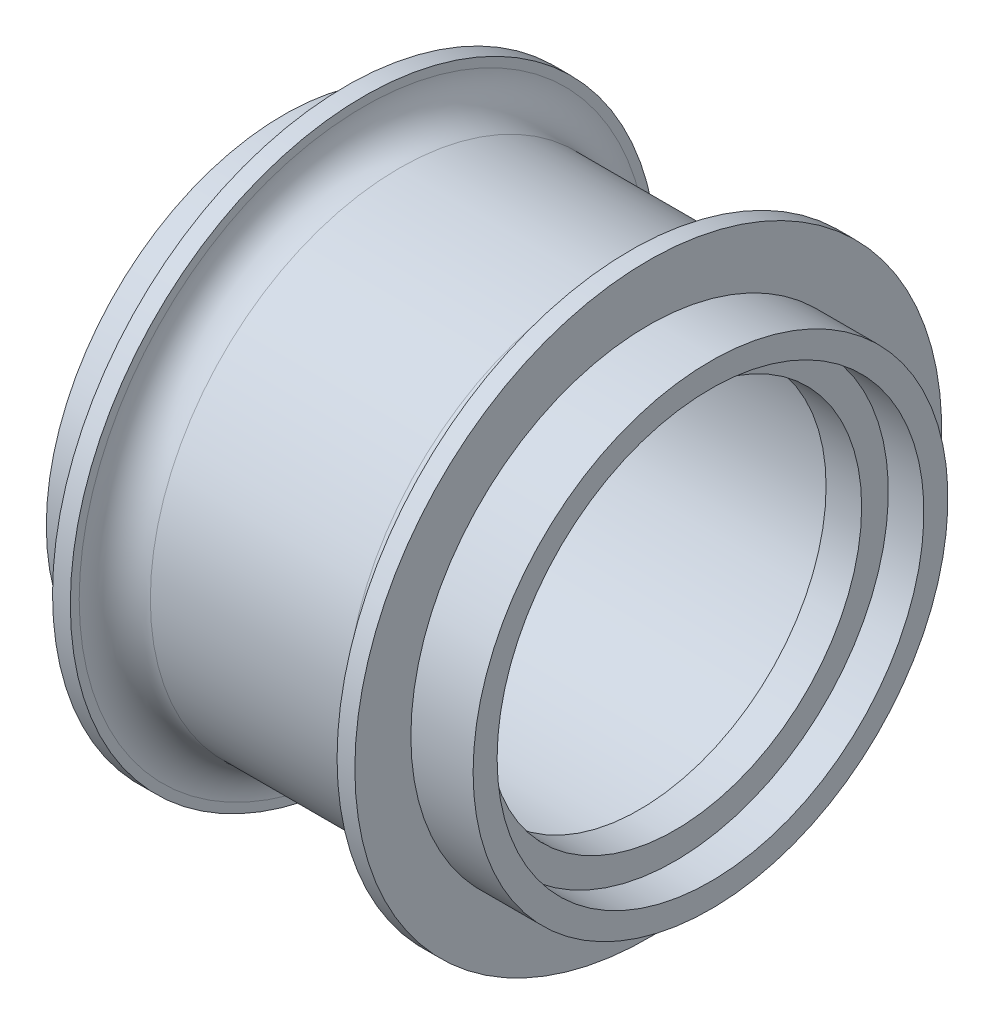
ISO-10303-21;
HEADER;
FILE_DESCRIPTION(('STEP AP214'),'2;1');
FILE_NAME('part.step','',(''),(''),'','','');
FILE_SCHEMA(('AUTOMOTIVE_DESIGN { 1 0 10303 214 1 1 1 1 }'));
ENDSEC;
DATA;
#1=APPLICATION_CONTEXT('core data for automotive mechanical design processes');
#2=APPLICATION_PROTOCOL_DEFINITION('international standard','automotive_design',2000,#1);
#3=PRODUCT_CONTEXT('',#1,'mechanical');
#4=PRODUCT('Part','Part','',(#3));
#5=PRODUCT_RELATED_PRODUCT_CATEGORY('part','',(#4));
#6=PRODUCT_DEFINITION_FORMATION('','',#4);
#7=PRODUCT_DEFINITION_CONTEXT('part definition',#1,'design');
#8=PRODUCT_DEFINITION('design','',#6,#7);
#9=PRODUCT_DEFINITION_SHAPE('','',#8);
#10=(LENGTH_UNIT() NAMED_UNIT(*) SI_UNIT(.MILLI.,.METRE.));
#11=(NAMED_UNIT(*) PLANE_ANGLE_UNIT() SI_UNIT($,.RADIAN.));
#12=(NAMED_UNIT(*) SI_UNIT($,.STERADIAN.) SOLID_ANGLE_UNIT());
#13=UNCERTAINTY_MEASURE_WITH_UNIT(LENGTH_MEASURE(1.E-05),#10,'distance_accuracy_value','');
#14=(GEOMETRIC_REPRESENTATION_CONTEXT(3) GLOBAL_UNCERTAINTY_ASSIGNED_CONTEXT((#13)) GLOBAL_UNIT_ASSIGNED_CONTEXT((#10,
#11,#12)) REPRESENTATION_CONTEXT('',''));
#15=CARTESIAN_POINT('',(0.,0.,0.));
#16=DIRECTION('',(0.,0.,1.));
#17=DIRECTION('',(1.,0.,0.));
#18=AXIS2_PLACEMENT_3D('',#15,#16,#17);
#19=CARTESIAN_POINT('',(-12.,13.35,0.));
#20=DIRECTION('',(1.,0.,0.));
#21=DIRECTION('',(0.,0.,-1.));
#22=AXIS2_PLACEMENT_3D('',#19,#20,#21);
#23=PLANE('',#22);
#24=CARTESIAN_POINT('',(-12.,0.,0.));
#25=DIRECTION('',(-1.,0.,0.));
#26=DIRECTION('',(0.,0.,1.));
#27=AXIS2_PLACEMENT_3D('',#24,#25,#26);
#28=CIRCLE('',#27,12.);
#29=CARTESIAN_POINT('',(-12.,0.,12.));
#30=VERTEX_POINT('',#29);
#31=EDGE_CURVE('E10',#30,#30,#28,.T.);
#32=ORIENTED_EDGE('',*,*,#31,.F.);
#33=EDGE_LOOP('',(#32));
#34=FACE_BOUND('',#33,.T.);
#35=CARTESIAN_POINT('',(-12.,0.,0.));
#36=DIRECTION('',(-1.,0.,0.));
#37=DIRECTION('',(0.,0.,1.));
#38=AXIS2_PLACEMENT_3D('',#35,#36,#37);
#39=CIRCLE('',#38,13.35);
#40=CARTESIAN_POINT('',(-12.,0.,13.35));
#41=VERTEX_POINT('',#40);
#42=EDGE_CURVE('E104',#41,#41,#39,.T.);
#43=ORIENTED_EDGE('',*,*,#42,.T.);
#44=EDGE_LOOP('',(#43));
#45=FACE_BOUND('',#44,.T.);
#46=ADVANCED_FACE('F34',(#34,#45),#23,.F.);
#47=CARTESIAN_POINT('',(-7.00198598517657,0.,0.));
#48=DIRECTION('',(-1.,0.,0.));
#49=DIRECTION('',(0.,0.,1.));
#50=AXIS2_PLACEMENT_3D('',#47,#48,#49);
#51=CYLINDRICAL_SURFACE('',#50,12.);
#52=CARTESIAN_POINT('',(-9.3,0.,0.));
#53=DIRECTION('',(-1.,0.,0.));
#54=DIRECTION('',(0.,0.,1.));
#55=AXIS2_PLACEMENT_3D('',#52,#53,#54);
#56=CIRCLE('',#55,12.);
#57=CARTESIAN_POINT('',(-9.3,0.,12.));
#58=VERTEX_POINT('',#57);
#59=EDGE_CURVE('E40',#58,#58,#56,.T.);
#60=ORIENTED_EDGE('',*,*,#59,.F.);
#61=EDGE_LOOP('',(#60));
#62=FACE_BOUND('',#61,.T.);
#63=ORIENTED_EDGE('',*,*,#31,.T.);
#64=EDGE_LOOP('',(#63));
#65=FACE_BOUND('',#64,.T.);
#66=ADVANCED_FACE('F225',(#62,#65),#51,.F.);
#67=CARTESIAN_POINT('',(-9.3,12.,0.));
#68=DIRECTION('',(-1.,0.,0.));
#69=DIRECTION('',(0.,0.,1.));
#70=AXIS2_PLACEMENT_3D('',#67,#68,#69);
#71=PLANE('',#70);
#72=CARTESIAN_POINT('',(-9.3,0.,0.));
#73=DIRECTION('',(-1.,0.,0.));
#74=DIRECTION('',(0.,0.,1.));
#75=AXIS2_PLACEMENT_3D('',#72,#73,#74);
#76=CIRCLE('',#75,12.6);
#77=CARTESIAN_POINT('',(-9.3,0.,12.6));
#78=VERTEX_POINT('',#77);
#79=EDGE_CURVE('E44',#78,#78,#76,.T.);
#80=ORIENTED_EDGE('',*,*,#79,.F.);
#81=EDGE_LOOP('',(#80));
#82=FACE_BOUND('',#81,.T.);
#83=ORIENTED_EDGE('',*,*,#59,.T.);
#84=EDGE_LOOP('',(#83));
#85=FACE_BOUND('',#84,.T.);
#86=ADVANCED_FACE('F220',(#82,#85),#71,.F.);
#87=CARTESIAN_POINT('',(-7.00198598517657,0.,0.));
#88=DIRECTION('',(-1.,0.,0.));
#89=DIRECTION('',(0.,0.,1.));
#90=AXIS2_PLACEMENT_3D('',#87,#88,#89);
#91=CYLINDRICAL_SURFACE('',#90,12.6);
#92=CARTESIAN_POINT('',(-8.,0.,0.));
#93=DIRECTION('',(-1.,0.,0.));
#94=DIRECTION('',(0.,0.,1.));
#95=AXIS2_PLACEMENT_3D('',#92,#93,#94);
#96=CIRCLE('',#95,12.6);
#97=CARTESIAN_POINT('',(-8.,0.,12.6));
#98=VERTEX_POINT('',#97);
#99=EDGE_CURVE('E48',#98,#98,#96,.T.);
#100=ORIENTED_EDGE('',*,*,#99,.F.);
#101=EDGE_LOOP('',(#100));
#102=FACE_BOUND('',#101,.T.);
#103=ORIENTED_EDGE('',*,*,#79,.T.);
#104=EDGE_LOOP('',(#103));
#105=FACE_BOUND('',#104,.T.);
#106=ADVANCED_FACE('F214',(#102,#105),#91,.F.);
#107=CARTESIAN_POINT('',(-8.,12.6,0.));
#108=DIRECTION('',(1.,0.,0.));
#109=DIRECTION('',(0.,0.,-1.));
#110=AXIS2_PLACEMENT_3D('',#107,#108,#109);
#111=PLANE('',#110);
#112=CARTESIAN_POINT('',(-8.,0.,0.));
#113=DIRECTION('',(-1.,0.,0.));
#114=DIRECTION('',(0.,0.,1.));
#115=AXIS2_PLACEMENT_3D('',#112,#113,#114);
#116=CIRCLE('',#115,12.);
#117=CARTESIAN_POINT('',(-8.,0.,12.));
#118=VERTEX_POINT('',#117);
#119=EDGE_CURVE('E53',#118,#118,#116,.T.);
#120=ORIENTED_EDGE('',*,*,#119,.F.);
#121=EDGE_LOOP('',(#120));
#122=FACE_BOUND('',#121,.T.);
#123=ORIENTED_EDGE('',*,*,#99,.T.);
#124=EDGE_LOOP('',(#123));
#125=FACE_BOUND('',#124,.T.);
#126=ADVANCED_FACE('F208',(#122,#125),#111,.F.);
#127=CARTESIAN_POINT('',(-7.00198598517657,0.,0.));
#128=DIRECTION('',(-1.,0.,0.));
#129=DIRECTION('',(0.,0.,1.));
#130=AXIS2_PLACEMENT_3D('',#127,#128,#129);
#131=CYLINDRICAL_SURFACE('',#130,12.);
#132=CARTESIAN_POINT('',(8.,0.,0.));
#133=DIRECTION('',(-1.,0.,0.));
#134=DIRECTION('',(0.,0.,1.));
#135=AXIS2_PLACEMENT_3D('',#132,#133,#134);
#136=CIRCLE('',#135,12.);
#137=CARTESIAN_POINT('',(8.,0.,12.));
#138=VERTEX_POINT('',#137);
#139=EDGE_CURVE('E56',#138,#138,#136,.T.);
#140=ORIENTED_EDGE('',*,*,#139,.F.);
#141=EDGE_LOOP('',(#140));
#142=FACE_BOUND('',#141,.T.);
#143=ORIENTED_EDGE('',*,*,#119,.T.);
#144=EDGE_LOOP('',(#143));
#145=FACE_BOUND('',#144,.T.);
#146=ADVANCED_FACE('F202',(#142,#145),#131,.F.);
#147=CARTESIAN_POINT('',(8.,12.,0.));
#148=DIRECTION('',(1.,0.,0.));
#149=DIRECTION('',(0.,0.,-1.));
#150=AXIS2_PLACEMENT_3D('',#147,#148,#149);
#151=PLANE('',#150);
#152=CARTESIAN_POINT('',(8.,0.,0.));
#153=DIRECTION('',(-1.,0.,0.));
#154=DIRECTION('',(0.,0.,1.));
#155=AXIS2_PLACEMENT_3D('',#152,#153,#154);
#156=CIRCLE('',#155,10.5);
#157=CARTESIAN_POINT('',(8.,0.,10.5));
#158=VERTEX_POINT('',#157);
#159=EDGE_CURVE('E59',#158,#158,#156,.T.);
#160=ORIENTED_EDGE('',*,*,#159,.F.);
#161=EDGE_LOOP('',(#160));
#162=FACE_BOUND('',#161,.T.);
#163=ORIENTED_EDGE('',*,*,#139,.T.);
#164=EDGE_LOOP('',(#163));
#165=FACE_BOUND('',#164,.T.);
#166=ADVANCED_FACE('F196',(#162,#165),#151,.F.);
#167=CARTESIAN_POINT('',(-7.00198598517657,0.,0.));
#168=DIRECTION('',(-1.,0.,0.));
#169=DIRECTION('',(0.,0.,1.));
#170=AXIS2_PLACEMENT_3D('',#167,#168,#169);
#171=CYLINDRICAL_SURFACE('',#170,10.5);
#172=CARTESIAN_POINT('',(10.,0.,0.));
#173=DIRECTION('',(-1.,0.,0.));
#174=DIRECTION('',(0.,0.,1.));
#175=AXIS2_PLACEMENT_3D('',#172,#173,#174);
#176=CIRCLE('',#175,10.5);
#177=CARTESIAN_POINT('',(10.,0.,10.5));
#178=VERTEX_POINT('',#177);
#179=EDGE_CURVE('E62',#178,#178,#176,.T.);
#180=ORIENTED_EDGE('',*,*,#179,.F.);
#181=EDGE_LOOP('',(#180));
#182=FACE_BOUND('',#181,.T.);
#183=ORIENTED_EDGE('',*,*,#159,.T.);
#184=EDGE_LOOP('',(#183));
#185=FACE_BOUND('',#184,.T.);
#186=ADVANCED_FACE('F190',(#182,#185),#171,.F.);
#187=CARTESIAN_POINT('',(10.,10.5,0.));
#188=DIRECTION('',(-1.,0.,0.));
#189=DIRECTION('',(0.,0.,1.));
#190=AXIS2_PLACEMENT_3D('',#187,#188,#189);
#191=PLANE('',#190);
#192=CARTESIAN_POINT('',(10.,0.,0.));
#193=DIRECTION('',(-1.,0.,0.));
#194=DIRECTION('',(0.,0.,1.));
#195=AXIS2_PLACEMENT_3D('',#192,#193,#194);
#196=CIRCLE('',#195,12.);
#197=CARTESIAN_POINT('',(10.,0.,12.));
#198=VERTEX_POINT('',#197);
#199=EDGE_CURVE('E65',#198,#198,#196,.T.);
#200=ORIENTED_EDGE('',*,*,#199,.F.);
#201=EDGE_LOOP('',(#200));
#202=FACE_BOUND('',#201,.T.);
#203=ORIENTED_EDGE('',*,*,#179,.T.);
#204=EDGE_LOOP('',(#203));
#205=FACE_BOUND('',#204,.T.);
#206=ADVANCED_FACE('F184',(#202,#205),#191,.F.);
#207=CARTESIAN_POINT('',(-7.00198598517657,0.,0.));
#208=DIRECTION('',(-1.,0.,0.));
#209=DIRECTION('',(0.,0.,1.));
#210=AXIS2_PLACEMENT_3D('',#207,#208,#209);
#211=CYLINDRICAL_SURFACE('',#210,12.);
#212=CARTESIAN_POINT('',(12.,0.,0.));
#213=DIRECTION('',(-1.,0.,0.));
#214=DIRECTION('',(0.,0.,1.));
#215=AXIS2_PLACEMENT_3D('',#212,#213,#214);
#216=CIRCLE('',#215,12.);
#217=CARTESIAN_POINT('',(12.,0.,12.));
#218=VERTEX_POINT('',#217);
#219=EDGE_CURVE('E68',#218,#218,#216,.T.);
#220=ORIENTED_EDGE('',*,*,#219,.F.);
#221=EDGE_LOOP('',(#220));
#222=FACE_BOUND('',#221,.T.);
#223=ORIENTED_EDGE('',*,*,#199,.T.);
#224=EDGE_LOOP('',(#223));
#225=FACE_BOUND('',#224,.T.);
#226=ADVANCED_FACE('F178',(#222,#225),#211,.F.);
#227=CARTESIAN_POINT('',(12.,13.35,0.));
#228=DIRECTION('',(-1.,0.,0.));
#229=DIRECTION('',(0.,0.,1.));
#230=AXIS2_PLACEMENT_3D('',#227,#228,#229);
#231=PLANE('',#230);
#232=CARTESIAN_POINT('',(12.,0.,0.));
#233=DIRECTION('',(-1.,0.,0.));
#234=DIRECTION('',(0.,0.,1.));
#235=AXIS2_PLACEMENT_3D('',#232,#233,#234);
#236=CIRCLE('',#235,13.35);
#237=CARTESIAN_POINT('',(12.,0.,13.35));
#238=VERTEX_POINT('',#237);
#239=EDGE_CURVE('E71',#238,#238,#236,.T.);
#240=ORIENTED_EDGE('',*,*,#239,.F.);
#241=EDGE_LOOP('',(#240));
#242=FACE_BOUND('',#241,.T.);
#243=ORIENTED_EDGE('',*,*,#219,.T.);
#244=EDGE_LOOP('',(#243));
#245=FACE_BOUND('',#244,.T.);
#246=ADVANCED_FACE('F172',(#242,#245),#231,.F.);
#247=CARTESIAN_POINT('',(-7.00198598517657,0.,0.));
#248=DIRECTION('',(-1.,0.,0.));
#249=DIRECTION('',(0.,0.,1.));
#250=AXIS2_PLACEMENT_3D('',#247,#248,#249);
#251=CYLINDRICAL_SURFACE('',#250,13.35);
#252=CARTESIAN_POINT('',(8.5,0.,0.));
#253=DIRECTION('',(-1.,0.,0.));
#254=DIRECTION('',(0.,0.,1.));
#255=AXIS2_PLACEMENT_3D('',#252,#253,#254);
#256=CIRCLE('',#255,13.35);
#257=CARTESIAN_POINT('',(8.5,0.,13.35));
#258=VERTEX_POINT('',#257);
#259=EDGE_CURVE('E74',#258,#258,#256,.T.);
#260=ORIENTED_EDGE('',*,*,#259,.F.);
#261=EDGE_LOOP('',(#260));
#262=FACE_BOUND('',#261,.T.);
#263=ORIENTED_EDGE('',*,*,#239,.T.);
#264=EDGE_LOOP('',(#263));
#265=FACE_BOUND('',#264,.T.);
#266=ADVANCED_FACE('F166',(#262,#265),#251,.T.);
#267=CARTESIAN_POINT('',(8.5,13.35,0.));
#268=DIRECTION('',(-1.,0.,0.));
#269=DIRECTION('',(0.,0.,1.));
#270=AXIS2_PLACEMENT_3D('',#267,#268,#269);
#271=PLANE('',#270);
#272=CARTESIAN_POINT('',(8.5,0.,0.));
#273=DIRECTION('',(-1.,0.,0.));
#274=DIRECTION('',(0.,0.,1.));
#275=AXIS2_PLACEMENT_3D('',#272,#273,#274);
#276=CIRCLE('',#275,16.5);
#277=CARTESIAN_POINT('',(8.5,0.,16.5));
#278=VERTEX_POINT('',#277);
#279=EDGE_CURVE('E77',#278,#278,#276,.T.);
#280=ORIENTED_EDGE('',*,*,#279,.F.);
#281=EDGE_LOOP('',(#280));
#282=FACE_BOUND('',#281,.T.);
#283=ORIENTED_EDGE('',*,*,#259,.T.);
#284=EDGE_LOOP('',(#283));
#285=FACE_BOUND('',#284,.T.);
#286=ADVANCED_FACE('F160',(#282,#285),#271,.F.);
#287=CARTESIAN_POINT('',(-7.00198598517657,0.,0.));
#288=DIRECTION('',(-1.,0.,0.));
#289=DIRECTION('',(0.,0.,1.));
#290=AXIS2_PLACEMENT_3D('',#287,#288,#289);
#291=CYLINDRICAL_SURFACE('',#290,16.5);
#292=CARTESIAN_POINT('',(7.5,0.,0.));
#293=DIRECTION('',(-1.,0.,0.));
#294=DIRECTION('',(0.,0.,1.));
#295=AXIS2_PLACEMENT_3D('',#292,#293,#294);
#296=CIRCLE('',#295,16.5);
#297=CARTESIAN_POINT('',(7.5,0.,16.5));
#298=VERTEX_POINT('',#297);
#299=EDGE_CURVE('E80',#298,#298,#296,.T.);
#300=ORIENTED_EDGE('',*,*,#299,.F.);
#301=EDGE_LOOP('',(#300));
#302=FACE_BOUND('',#301,.T.);
#303=ORIENTED_EDGE('',*,*,#279,.T.);
#304=EDGE_LOOP('',(#303));
#305=FACE_BOUND('',#304,.T.);
#306=ADVANCED_FACE('F154',(#302,#305),#291,.T.);
#307=CARTESIAN_POINT('',(7.5,16.,0.));
#308=DIRECTION('',(1.,0.,0.));
#309=DIRECTION('',(0.,0.,-1.));
#310=AXIS2_PLACEMENT_3D('',#307,#308,#309);
#311=PLANE('',#310);
#312=CARTESIAN_POINT('',(7.5,0.,0.));
#313=DIRECTION('',(-1.,0.,0.));
#314=DIRECTION('',(0.,0.,1.));
#315=AXIS2_PLACEMENT_3D('',#312,#313,#314);
#316=CIRCLE('',#315,16.);
#317=CARTESIAN_POINT('',(7.5,0.,16.));
#318=VERTEX_POINT('',#317);
#319=EDGE_CURVE('E83',#318,#318,#316,.T.);
#320=ORIENTED_EDGE('',*,*,#319,.F.);
#321=EDGE_LOOP('',(#320));
#322=FACE_BOUND('',#321,.T.);
#323=ORIENTED_EDGE('',*,*,#299,.T.);
#324=EDGE_LOOP('',(#323));
#325=FACE_BOUND('',#324,.T.);
#326=ADVANCED_FACE('F148',(#322,#325),#311,.F.);
#327=CARTESIAN_POINT('',(5.5,0.,0.));
#328=DIRECTION('',(-1.,0.,0.));
#329=DIRECTION('',(0.,0.,1.));
#330=AXIS2_PLACEMENT_3D('',#327,#328,#329);
#331=TOROIDAL_SURFACE('',#330,16.,2.);
#332=CARTESIAN_POINT('',(5.5,0.,0.));
#333=DIRECTION('',(-1.,0.,0.));
#334=DIRECTION('',(0.,0.,1.));
#335=AXIS2_PLACEMENT_3D('',#332,#333,#334);
#336=CIRCLE('',#335,14.);
#337=CARTESIAN_POINT('',(5.5,0.,14.));
#338=VERTEX_POINT('',#337);
#339=EDGE_CURVE('E86',#338,#338,#336,.T.);
#340=ORIENTED_EDGE('',*,*,#339,.F.);
#341=EDGE_LOOP('',(#340));
#342=FACE_BOUND('',#341,.T.);
#343=ORIENTED_EDGE('',*,*,#319,.T.);
#344=EDGE_LOOP('',(#343));
#345=FACE_BOUND('',#344,.T.);
#346=ADVANCED_FACE('F142',(#342,#345),#331,.F.);
#347=CARTESIAN_POINT('',(-7.00198598517657,0.,0.));
#348=DIRECTION('',(-1.,0.,0.));
#349=DIRECTION('',(0.,0.,1.));
#350=AXIS2_PLACEMENT_3D('',#347,#348,#349);
#351=CYLINDRICAL_SURFACE('',#350,14.);
#352=CARTESIAN_POINT('',(-5.5,0.,0.));
#353=DIRECTION('',(-1.,0.,0.));
#354=DIRECTION('',(0.,0.,1.));
#355=AXIS2_PLACEMENT_3D('',#352,#353,#354);
#356=CIRCLE('',#355,14.);
#357=CARTESIAN_POINT('',(-5.5,0.,14.));
#358=VERTEX_POINT('',#357);
#359=EDGE_CURVE('E89',#358,#358,#356,.T.);
#360=ORIENTED_EDGE('',*,*,#359,.F.);
#361=EDGE_LOOP('',(#360));
#362=FACE_BOUND('',#361,.T.);
#363=ORIENTED_EDGE('',*,*,#339,.T.);
#364=EDGE_LOOP('',(#363));
#365=FACE_BOUND('',#364,.T.);
#366=ADVANCED_FACE('F136',(#362,#365),#351,.T.);
#367=CARTESIAN_POINT('',(-5.5,0.,0.));
#368=DIRECTION('',(-1.,0.,0.));
#369=DIRECTION('',(0.,0.,1.));
#370=AXIS2_PLACEMENT_3D('',#367,#368,#369);
#371=TOROIDAL_SURFACE('',#370,16.,2.);
#372=CARTESIAN_POINT('',(-7.5,0.,0.));
#373=DIRECTION('',(-1.,0.,0.));
#374=DIRECTION('',(0.,0.,1.));
#375=AXIS2_PLACEMENT_3D('',#372,#373,#374);
#376=CIRCLE('',#375,16.);
#377=CARTESIAN_POINT('',(-7.5,0.,16.));
#378=VERTEX_POINT('',#377);
#379=EDGE_CURVE('E92',#378,#378,#376,.T.);
#380=ORIENTED_EDGE('',*,*,#379,.F.);
#381=EDGE_LOOP('',(#380));
#382=FACE_BOUND('',#381,.T.);
#383=ORIENTED_EDGE('',*,*,#359,.T.);
#384=EDGE_LOOP('',(#383));
#385=FACE_BOUND('',#384,.T.);
#386=ADVANCED_FACE('F130',(#382,#385),#371,.F.);
#387=CARTESIAN_POINT('',(-7.5,16.5,0.));
#388=DIRECTION('',(-1.,0.,0.));
#389=DIRECTION('',(0.,0.,1.));
#390=AXIS2_PLACEMENT_3D('',#387,#388,#389);
#391=PLANE('',#390);
#392=CARTESIAN_POINT('',(-7.5,0.,0.));
#393=DIRECTION('',(-1.,0.,0.));
#394=DIRECTION('',(0.,0.,1.));
#395=AXIS2_PLACEMENT_3D('',#392,#393,#394);
#396=CIRCLE('',#395,16.5);
#397=CARTESIAN_POINT('',(-7.5,0.,16.5));
#398=VERTEX_POINT('',#397);
#399=EDGE_CURVE('E95',#398,#398,#396,.T.);
#400=ORIENTED_EDGE('',*,*,#399,.F.);
#401=EDGE_LOOP('',(#400));
#402=FACE_BOUND('',#401,.T.);
#403=ORIENTED_EDGE('',*,*,#379,.T.);
#404=EDGE_LOOP('',(#403));
#405=FACE_BOUND('',#404,.T.);
#406=ADVANCED_FACE('F124',(#402,#405),#391,.F.);
#407=CARTESIAN_POINT('',(-7.00198598517657,0.,0.));
#408=DIRECTION('',(-1.,0.,0.));
#409=DIRECTION('',(0.,0.,1.));
#410=AXIS2_PLACEMENT_3D('',#407,#408,#409);
#411=CYLINDRICAL_SURFACE('',#410,16.5);
#412=CARTESIAN_POINT('',(-8.5,0.,0.));
#413=DIRECTION('',(-1.,0.,0.));
#414=DIRECTION('',(0.,0.,1.));
#415=AXIS2_PLACEMENT_3D('',#412,#413,#414);
#416=CIRCLE('',#415,16.5);
#417=CARTESIAN_POINT('',(-8.5,0.,16.5));
#418=VERTEX_POINT('',#417);
#419=EDGE_CURVE('E98',#418,#418,#416,.T.);
#420=ORIENTED_EDGE('',*,*,#419,.F.);
#421=EDGE_LOOP('',(#420));
#422=FACE_BOUND('',#421,.T.);
#423=ORIENTED_EDGE('',*,*,#399,.T.);
#424=EDGE_LOOP('',(#423));
#425=FACE_BOUND('',#424,.T.);
#426=ADVANCED_FACE('F118',(#422,#425),#411,.T.);
#427=CARTESIAN_POINT('',(-8.5,13.35,0.));
#428=DIRECTION('',(1.,0.,0.));
#429=DIRECTION('',(0.,0.,-1.));
#430=AXIS2_PLACEMENT_3D('',#427,#428,#429);
#431=PLANE('',#430);
#432=CARTESIAN_POINT('',(-8.5,0.,0.));
#433=DIRECTION('',(-1.,0.,0.));
#434=DIRECTION('',(0.,0.,1.));
#435=AXIS2_PLACEMENT_3D('',#432,#433,#434);
#436=CIRCLE('',#435,13.35);
#437=CARTESIAN_POINT('',(-8.5,0.,13.35));
#438=VERTEX_POINT('',#437);
#439=EDGE_CURVE('E101',#438,#438,#436,.T.);
#440=ORIENTED_EDGE('',*,*,#439,.F.);
#441=EDGE_LOOP('',(#440));
#442=FACE_BOUND('',#441,.T.);
#443=ORIENTED_EDGE('',*,*,#419,.T.);
#444=EDGE_LOOP('',(#443));
#445=FACE_BOUND('',#444,.T.);
#446=ADVANCED_FACE('F112',(#442,#445),#431,.F.);
#447=CARTESIAN_POINT('',(-7.00198598517657,0.,0.));
#448=DIRECTION('',(-1.,0.,0.));
#449=DIRECTION('',(0.,0.,1.));
#450=AXIS2_PLACEMENT_3D('',#447,#448,#449);
#451=CYLINDRICAL_SURFACE('',#450,13.35);
#452=ORIENTED_EDGE('',*,*,#42,.F.);
#453=EDGE_LOOP('',(#452));
#454=FACE_BOUND('',#453,.T.);
#455=ORIENTED_EDGE('',*,*,#439,.T.);
#456=EDGE_LOOP('',(#455));
#457=FACE_BOUND('',#456,.T.);
#458=ADVANCED_FACE('F109',(#454,#457),#451,.T.);
#459=CLOSED_SHELL('',(#46,#66,#86,#106,#126,#146,#166,#186,#206,#226,#246,#266,#286,#306,#326,
#346,#366,#386,#406,#426,#446,#458));
#460=MANIFOLD_SOLID_BREP('B2',#459);
#461=ADVANCED_BREP_SHAPE_REPRESENTATION('',(#18,#460),#14);
#462=SHAPE_DEFINITION_REPRESENTATION(#9,#461);
ENDSEC;
END-ISO-10303-21;
